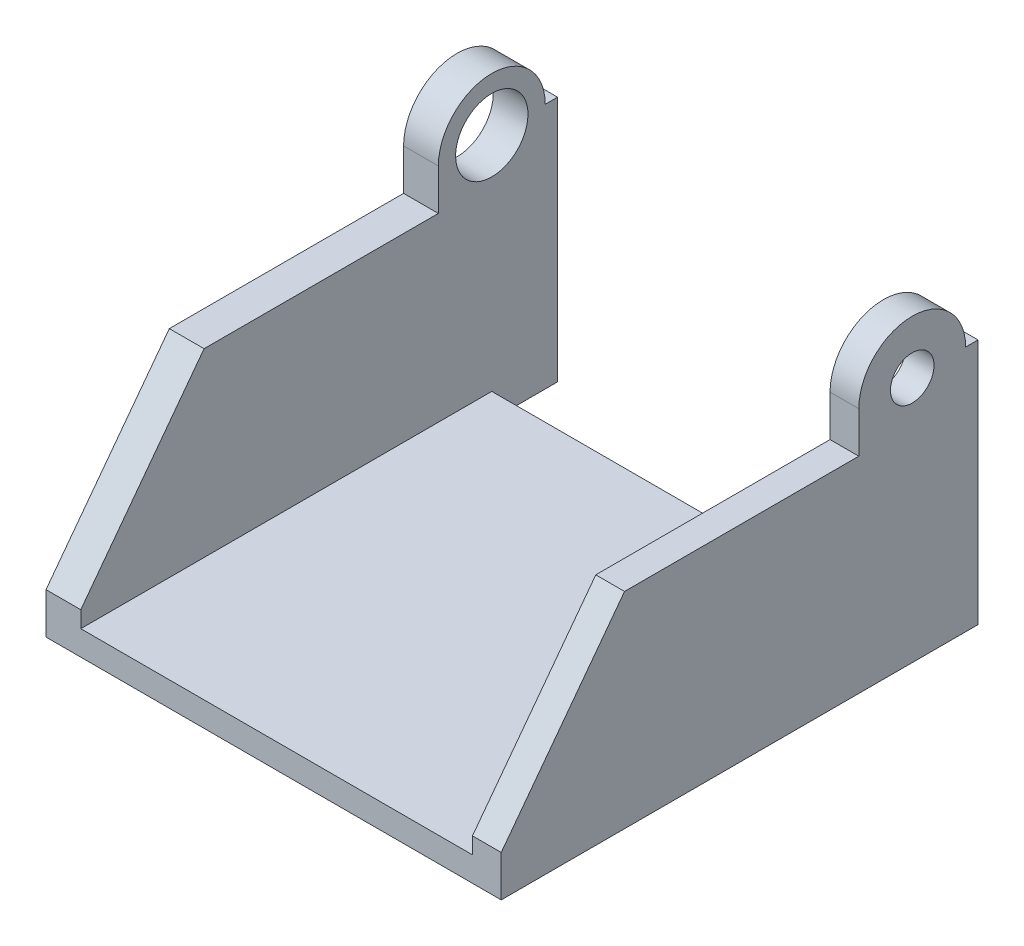
ISO-10303-21;
HEADER;
FILE_DESCRIPTION(('STEP AP214'),'2;1');
FILE_NAME('part.step','',(''),(''),'','','');
FILE_SCHEMA(('AUTOMOTIVE_DESIGN { 1 0 10303 214 1 1 1 1 }'));
ENDSEC;
DATA;
#1=APPLICATION_CONTEXT('core data for automotive mechanical design processes');
#2=APPLICATION_PROTOCOL_DEFINITION('international standard','automotive_design',2000,#1);
#3=PRODUCT_CONTEXT('',#1,'mechanical');
#4=PRODUCT('Part','Part','',(#3));
#5=PRODUCT_RELATED_PRODUCT_CATEGORY('part','',(#4));
#6=PRODUCT_DEFINITION_FORMATION('','',#4);
#7=PRODUCT_DEFINITION_CONTEXT('part definition',#1,'design');
#8=PRODUCT_DEFINITION('design','',#6,#7);
#9=PRODUCT_DEFINITION_SHAPE('','',#8);
#10=(LENGTH_UNIT() NAMED_UNIT(*) SI_UNIT(.MILLI.,.METRE.));
#11=(NAMED_UNIT(*) PLANE_ANGLE_UNIT() SI_UNIT($,.RADIAN.));
#12=(NAMED_UNIT(*) SI_UNIT($,.STERADIAN.) SOLID_ANGLE_UNIT());
#13=UNCERTAINTY_MEASURE_WITH_UNIT(LENGTH_MEASURE(1.E-05),#10,'distance_accuracy_value','');
#14=(GEOMETRIC_REPRESENTATION_CONTEXT(3) GLOBAL_UNCERTAINTY_ASSIGNED_CONTEXT((#13)) GLOBAL_UNIT_ASSIGNED_CONTEXT((#10,
#11,#12)) REPRESENTATION_CONTEXT('',''));
#15=CARTESIAN_POINT('',(0.,0.,0.));
#16=DIRECTION('',(0.,0.,1.));
#17=DIRECTION('',(1.,0.,0.));
#18=AXIS2_PLACEMENT_3D('',#15,#16,#17);
#19=CARTESIAN_POINT('',(-54.65,0.,50.));
#20=DIRECTION('',(0.,0.,1.));
#21=DIRECTION('',(-1.,0.,0.));
#22=AXIS2_PLACEMENT_3D('',#19,#20,#21);
#23=PLANE('',#22);
#24=DIRECTION('',(1.,0.,0.));
#25=VECTOR('',#24,1.);
#26=CARTESIAN_POINT('',(-54.65,-30.,50.));
#27=LINE('',#26,#25);
#28=CARTESIAN_POINT('',(-82.705,-30.,50.));
#29=VERTEX_POINT('',#28);
#30=CARTESIAN_POINT('',(-27.325,-30.,50.));
#31=VERTEX_POINT('',#30);
#32=EDGE_CURVE('E270',#29,#31,#27,.T.);
#33=ORIENTED_EDGE('',*,*,#32,.T.);
#34=DIRECTION('',(0.,-1.,0.));
#35=VECTOR('',#34,1.);
#36=CARTESIAN_POINT('',(-27.325,0.,50.));
#37=LINE('',#36,#35);
#38=CARTESIAN_POINT('',(-27.325,-25.,50.));
#39=VERTEX_POINT('',#38);
#40=EDGE_CURVE('E266',#39,#31,#37,.T.);
#41=ORIENTED_EDGE('',*,*,#40,.F.);
#42=DIRECTION('',(-1.,0.,0.));
#43=VECTOR('',#42,1.);
#44=CARTESIAN_POINT('',(-54.65,-25.,50.));
#45=LINE('',#44,#43);
#46=CARTESIAN_POINT('',(-30.825,-25.,50.));
#47=VERTEX_POINT('',#46);
#48=EDGE_CURVE('E296',#39,#47,#45,.T.);
#49=ORIENTED_EDGE('',*,*,#48,.T.);
#50=DIRECTION('',(0.,-1.,0.));
#51=VECTOR('',#50,1.);
#52=CARTESIAN_POINT('',(-30.825,0.,50.));
#53=LINE('',#52,#51);
#54=CARTESIAN_POINT('',(-30.825,-27.,50.));
#55=VERTEX_POINT('',#54);
#56=EDGE_CURVE('E279',#47,#55,#53,.T.);
#57=ORIENTED_EDGE('',*,*,#56,.T.);
#58=DIRECTION('',(-1.,0.,0.));
#59=VECTOR('',#58,1.);
#60=CARTESIAN_POINT('',(-54.65,-27.,50.));
#61=LINE('',#60,#59);
#62=CARTESIAN_POINT('',(-78.475,-27.,50.));
#63=VERTEX_POINT('',#62);
#64=EDGE_CURVE('E275',#55,#63,#61,.T.);
#65=ORIENTED_EDGE('',*,*,#64,.T.);
#66=DIRECTION('',(0.,-1.,0.));
#67=VECTOR('',#66,1.);
#68=CARTESIAN_POINT('',(-78.475,0.,50.));
#69=LINE('',#68,#67);
#70=CARTESIAN_POINT('',(-78.475,-25.,50.));
#71=VERTEX_POINT('',#70);
#72=EDGE_CURVE('E217',#71,#63,#69,.T.);
#73=ORIENTED_EDGE('',*,*,#72,.F.);
#74=DIRECTION('',(1.,0.,0.));
#75=VECTOR('',#74,1.);
#76=CARTESIAN_POINT('',(-54.65,-25.,50.));
#77=LINE('',#76,#75);
#78=CARTESIAN_POINT('',(-82.705,-25.,50.));
#79=VERTEX_POINT('',#78);
#80=EDGE_CURVE('E11',#79,#71,#77,.T.);
#81=ORIENTED_EDGE('',*,*,#80,.F.);
#82=DIRECTION('',(0.,-1.,0.));
#83=VECTOR('',#82,1.);
#84=CARTESIAN_POINT('',(-82.705,-25.,50.));
#85=LINE('',#84,#83);
#86=EDGE_CURVE('E363',#79,#29,#85,.T.);
#87=ORIENTED_EDGE('',*,*,#86,.T.);
#88=EDGE_LOOP('',(#33,#41,#49,#57,#65,#73,#81,#87));
#89=FACE_BOUND('',#88,.T.);
#90=ADVANCED_FACE('F49',(#89),#23,.T.);
#91=CARTESIAN_POINT('',(-54.65,-30.,50.));
#92=DIRECTION('',(0.,-1.,0.));
#93=DIRECTION('',(0.,0.,-1.));
#94=AXIS2_PLACEMENT_3D('',#91,#92,#93);
#95=PLANE('',#94);
#96=DIRECTION('',(1.,0.,0.));
#97=VECTOR('',#96,1.);
#98=CARTESIAN_POINT('',(-81.975,-30.,-8.));
#99=LINE('',#98,#97);
#100=CARTESIAN_POINT('',(-82.705,-30.,-8.));
#101=VERTEX_POINT('',#100);
#102=CARTESIAN_POINT('',(-78.475,-30.,-8.));
#103=VERTEX_POINT('',#102);
#104=EDGE_CURVE('E186',#101,#103,#99,.T.);
#105=ORIENTED_EDGE('',*,*,#104,.T.);
#106=DIRECTION('',(0.,0.,-1.));
#107=VECTOR('',#106,1.);
#108=CARTESIAN_POINT('',(-78.475,-30.,0.));
#109=LINE('',#108,#107);
#110=CARTESIAN_POINT('',(-78.475,-30.,0.));
#111=VERTEX_POINT('',#110);
#112=EDGE_CURVE('E329',#111,#103,#109,.T.);
#113=ORIENTED_EDGE('',*,*,#112,.F.);
#114=DIRECTION('',(1.,0.,0.));
#115=VECTOR('',#114,1.);
#116=CARTESIAN_POINT('',(-54.65,-30.,0.));
#117=LINE('',#116,#115);
#118=CARTESIAN_POINT('',(-30.825,-30.,0.));
#119=VERTEX_POINT('',#118);
#120=EDGE_CURVE('E257',#111,#119,#117,.T.);
#121=ORIENTED_EDGE('',*,*,#120,.T.);
#122=DIRECTION('',(0.,0.,-1.));
#123=VECTOR('',#122,1.);
#124=CARTESIAN_POINT('',(-30.825,-30.,0.));
#125=LINE('',#124,#123);
#126=CARTESIAN_POINT('',(-30.825,-30.,-8.));
#127=VERTEX_POINT('',#126);
#128=EDGE_CURVE('E248',#119,#127,#125,.T.);
#129=ORIENTED_EDGE('',*,*,#128,.T.);
#130=DIRECTION('',(-1.,0.,0.));
#131=VECTOR('',#130,1.);
#132=CARTESIAN_POINT('',(-27.325,-30.,-8.));
#133=LINE('',#132,#131);
#134=CARTESIAN_POINT('',(-27.325,-30.,-8.));
#135=VERTEX_POINT('',#134);
#136=EDGE_CURVE('E258',#135,#127,#133,.T.);
#137=ORIENTED_EDGE('',*,*,#136,.F.);
#138=DIRECTION('',(0.,0.,-1.));
#139=VECTOR('',#138,1.);
#140=CARTESIAN_POINT('',(-27.325,-30.,50.));
#141=LINE('',#140,#139);
#142=EDGE_CURVE('E292',#31,#135,#141,.T.);
#143=ORIENTED_EDGE('',*,*,#142,.F.);
#144=ORIENTED_EDGE('',*,*,#32,.F.);
#145=DIRECTION('',(0.,0.,-1.));
#146=VECTOR('',#145,1.);
#147=CARTESIAN_POINT('',(-82.705,-30.,50.));
#148=LINE('',#147,#146);
#149=EDGE_CURVE('E358',#29,#101,#148,.T.);
#150=ORIENTED_EDGE('',*,*,#149,.T.);
#151=EDGE_LOOP('',(#105,#113,#121,#129,#137,#143,#144,#150));
#152=FACE_BOUND('',#151,.T.);
#153=ADVANCED_FACE('F356',(#152),#95,.T.);
#154=CARTESIAN_POINT('',(-81.975,0.,0.));
#155=DIRECTION('',(0.,1.,0.));
#156=DIRECTION('',(0.,0.,1.));
#157=AXIS2_PLACEMENT_3D('',#154,#155,#156);
#158=PLANE('',#157);
#159=DIRECTION('',(1.,0.,0.));
#160=VECTOR('',#159,1.);
#161=CARTESIAN_POINT('',(-81.975,0.,-6.5));
#162=LINE('',#161,#160);
#163=CARTESIAN_POINT('',(-82.705,0.,-6.5));
#164=VERTEX_POINT('',#163);
#165=CARTESIAN_POINT('',(-78.475,0.,-6.5));
#166=VERTEX_POINT('',#165);
#167=EDGE_CURVE('E222',#164,#166,#162,.T.);
#168=ORIENTED_EDGE('',*,*,#167,.T.);
#169=DIRECTION('',(0.,0.,-1.));
#170=VECTOR('',#169,1.);
#171=CARTESIAN_POINT('',(-78.475,0.,0.));
#172=LINE('',#171,#170);
#173=CARTESIAN_POINT('',(-78.475,0.,-8.));
#174=VERTEX_POINT('',#173);
#175=EDGE_CURVE('E205',#166,#174,#172,.T.);
#176=ORIENTED_EDGE('',*,*,#175,.T.);
#177=DIRECTION('',(1.,0.,0.));
#178=VECTOR('',#177,1.);
#179=CARTESIAN_POINT('',(-81.975,0.,-8.));
#180=LINE('',#179,#178);
#181=CARTESIAN_POINT('',(-82.705,0.,-8.));
#182=VERTEX_POINT('',#181);
#183=EDGE_CURVE('E183',#182,#174,#180,.T.);
#184=ORIENTED_EDGE('',*,*,#183,.F.);
#185=DIRECTION('',(0.,0.,1.));
#186=VECTOR('',#185,1.);
#187=CARTESIAN_POINT('',(-82.705,0.,-8.));
#188=LINE('',#187,#186);
#189=EDGE_CURVE('E190',#182,#164,#188,.T.);
#190=ORIENTED_EDGE('',*,*,#189,.T.);
#191=EDGE_LOOP('',(#168,#176,#184,#190));
#192=FACE_BOUND('',#191,.T.);
#193=ADVANCED_FACE('F203',(#192),#158,.T.);
#194=CARTESIAN_POINT('',(-81.975,0.,0.));
#195=DIRECTION('',(1.,0.,0.));
#196=DIRECTION('',(0.,-1.,0.));
#197=AXIS2_PLACEMENT_3D('',#194,#195,#196);
#198=CYLINDRICAL_SURFACE('',#197,6.5);
#199=DIRECTION('',(1.,0.,0.));
#200=VECTOR('',#199,1.);
#201=CARTESIAN_POINT('',(-81.975,0.,6.5));
#202=LINE('',#201,#200);
#203=CARTESIAN_POINT('',(-82.705,0.,6.5));
#204=VERTEX_POINT('',#203);
#205=CARTESIAN_POINT('',(-78.475,0.,6.5));
#206=VERTEX_POINT('',#205);
#207=EDGE_CURVE('E211',#204,#206,#202,.T.);
#208=ORIENTED_EDGE('',*,*,#207,.T.);
#209=CARTESIAN_POINT('',(-78.475,0.,0.));
#210=DIRECTION('',(1.,0.,0.));
#211=DIRECTION('',(0.,1.,0.));
#212=AXIS2_PLACEMENT_3D('',#209,#210,#211);
#213=CIRCLE('',#212,6.5);
#214=EDGE_CURVE('E207',#166,#206,#213,.T.);
#215=ORIENTED_EDGE('',*,*,#214,.F.);
#216=ORIENTED_EDGE('',*,*,#167,.F.);
#217=CARTESIAN_POINT('',(-82.705,0.,0.));
#218=DIRECTION('',(1.,0.,0.));
#219=DIRECTION('',(0.,1.,0.));
#220=AXIS2_PLACEMENT_3D('',#217,#218,#219);
#221=CIRCLE('',#220,6.5);
#222=EDGE_CURVE('E197',#164,#204,#221,.T.);
#223=ORIENTED_EDGE('',*,*,#222,.T.);
#224=EDGE_LOOP('',(#208,#215,#216,#223));
#225=FACE_BOUND('',#224,.T.);
#226=ADVANCED_FACE('F339',(#225),#198,.T.);
#227=CARTESIAN_POINT('',(-81.975,0.,-8.));
#228=DIRECTION('',(0.,0.,-1.));
#229=DIRECTION('',(0.,1.,0.));
#230=AXIS2_PLACEMENT_3D('',#227,#228,#229);
#231=PLANE('',#230);
#232=ORIENTED_EDGE('',*,*,#183,.T.);
#233=DIRECTION('',(0.,-1.,0.));
#234=VECTOR('',#233,1.);
#235=CARTESIAN_POINT('',(-78.475,0.,-8.));
#236=LINE('',#235,#234);
#237=EDGE_CURVE('E326',#174,#103,#236,.T.);
#238=ORIENTED_EDGE('',*,*,#237,.T.);
#239=ORIENTED_EDGE('',*,*,#104,.F.);
#240=DIRECTION('',(0.,1.,0.));
#241=VECTOR('',#240,1.);
#242=CARTESIAN_POINT('',(-82.705,-30.,-8.));
#243=LINE('',#242,#241);
#244=EDGE_CURVE('E179',#101,#182,#243,.T.);
#245=ORIENTED_EDGE('',*,*,#244,.T.);
#246=EDGE_LOOP('',(#232,#238,#239,#245));
#247=FACE_BOUND('',#246,.T.);
#248=ADVANCED_FACE('F181',(#247),#231,.T.);
#249=CARTESIAN_POINT('',(-74.825,-5.00000000000001,0.));
#250=DIRECTION('',(0.,1.,0.));
#251=DIRECTION('',(1.,0.,0.));
#252=AXIS2_PLACEMENT_3D('',#249,#250,#251);
#253=PLANE('',#252);
#254=DIRECTION('',(-1.,0.,0.));
#255=VECTOR('',#254,1.);
#256=CARTESIAN_POINT('',(-74.825,-5.00000000000001,35.));
#257=LINE('',#256,#255);
#258=CARTESIAN_POINT('',(-78.475,-5.00000000000002,35.));
#259=VERTEX_POINT('',#258);
#260=CARTESIAN_POINT('',(-82.705,-5.00000000000001,35.));
#261=VERTEX_POINT('',#260);
#262=EDGE_CURVE('E362',#259,#261,#257,.T.);
#263=ORIENTED_EDGE('',*,*,#262,.F.);
#264=DIRECTION('',(0.,0.,1.));
#265=VECTOR('',#264,1.);
#266=CARTESIAN_POINT('',(-78.475,-5.00000000000001,50.));
#267=LINE('',#266,#265);
#268=CARTESIAN_POINT('',(-78.475,-5.00000000000001,6.5));
#269=VERTEX_POINT('',#268);
#270=EDGE_CURVE('E377',#269,#259,#267,.T.);
#271=ORIENTED_EDGE('',*,*,#270,.F.);
#272=DIRECTION('',(-1.,0.,0.));
#273=VECTOR('',#272,1.);
#274=CARTESIAN_POINT('',(-74.825,-5.00000000000001,6.5));
#275=LINE('',#274,#273);
#276=CARTESIAN_POINT('',(-82.705,-5.00000000000002,6.5));
#277=VERTEX_POINT('',#276);
#278=EDGE_CURVE('E347',#269,#277,#275,.T.);
#279=ORIENTED_EDGE('',*,*,#278,.T.);
#280=DIRECTION('',(0.,0.,1.));
#281=VECTOR('',#280,1.);
#282=CARTESIAN_POINT('',(-82.705,-5.00000000000002,6.5));
#283=LINE('',#282,#281);
#284=EDGE_CURVE('E401',#277,#261,#283,.T.);
#285=ORIENTED_EDGE('',*,*,#284,.T.);
#286=EDGE_LOOP('',(#263,#271,#279,#285));
#287=FACE_BOUND('',#286,.T.);
#288=ADVANCED_FACE('F406',(#287),#253,.T.);
#289=CARTESIAN_POINT('',(-74.825,15.,20.));
#290=DIRECTION('',(0.,0.6,0.8));
#291=DIRECTION('',(0.,-0.8,0.6));
#292=AXIS2_PLACEMENT_3D('',#289,#290,#291);
#293=PLANE('',#292);
#294=ORIENTED_EDGE('',*,*,#80,.T.);
#295=DIRECTION('',(0.,-0.8,0.6));
#296=VECTOR('',#295,1.);
#297=CARTESIAN_POINT('',(-78.475,-9.00000000000002,38.));
#298=LINE('',#297,#296);
#299=EDGE_CURVE('E351',#259,#71,#298,.T.);
#300=ORIENTED_EDGE('',*,*,#299,.F.);
#301=ORIENTED_EDGE('',*,*,#262,.T.);
#302=DIRECTION('',(0.,-0.8,0.6));
#303=VECTOR('',#302,1.);
#304=CARTESIAN_POINT('',(-82.705,-5.00000000000001,35.));
#305=LINE('',#304,#303);
#306=EDGE_CURVE('E369',#261,#79,#305,.T.);
#307=ORIENTED_EDGE('',*,*,#306,.T.);
#308=EDGE_LOOP('',(#294,#300,#301,#307));
#309=FACE_BOUND('',#308,.T.);
#310=ADVANCED_FACE('F409',(#309),#293,.T.);
#311=CARTESIAN_POINT('',(-74.825,0.,6.5));
#312=DIRECTION('',(0.,0.,1.));
#313=DIRECTION('',(0.,-1.,0.));
#314=AXIS2_PLACEMENT_3D('',#311,#312,#313);
#315=PLANE('',#314);
#316=ORIENTED_EDGE('',*,*,#278,.F.);
#317=DIRECTION('',(0.,-1.,0.));
#318=VECTOR('',#317,1.);
#319=CARTESIAN_POINT('',(-78.475,0.,6.5));
#320=LINE('',#319,#318);
#321=EDGE_CURVE('E345',#206,#269,#320,.T.);
#322=ORIENTED_EDGE('',*,*,#321,.F.);
#323=ORIENTED_EDGE('',*,*,#207,.F.);
#324=DIRECTION('',(0.,-1.,0.));
#325=VECTOR('',#324,1.);
#326=CARTESIAN_POINT('',(-82.705,0.,6.5));
#327=LINE('',#326,#325);
#328=EDGE_CURVE('E343',#204,#277,#327,.T.);
#329=ORIENTED_EDGE('',*,*,#328,.T.);
#330=EDGE_LOOP('',(#316,#322,#323,#329));
#331=FACE_BOUND('',#330,.T.);
#332=ADVANCED_FACE('F342',(#331),#315,.T.);
#333=CARTESIAN_POINT('',(-78.475,0.,50.));
#334=DIRECTION('',(-1.,0.,0.));
#335=DIRECTION('',(0.,1.,0.));
#336=AXIS2_PLACEMENT_3D('',#333,#334,#335);
#337=PLANE('',#336);
#338=CARTESIAN_POINT('',(-78.475,0.,0.));
#339=DIRECTION('',(1.,0.,0.));
#340=DIRECTION('',(0.,1.,0.));
#341=AXIS2_PLACEMENT_3D('',#338,#339,#340);
#342=CIRCLE('',#341,4.4);
#343=CARTESIAN_POINT('',(-78.475,4.39999999999999,0.));
#344=VERTEX_POINT('',#343);
#345=EDGE_CURVE('E468',#344,#344,#342,.T.);
#346=ORIENTED_EDGE('',*,*,#345,.F.);
#347=EDGE_LOOP('',(#346));
#348=FACE_BOUND('',#347,.T.);
#349=ORIENTED_EDGE('',*,*,#321,.T.);
#350=ORIENTED_EDGE('',*,*,#270,.T.);
#351=ORIENTED_EDGE('',*,*,#299,.T.);
#352=ORIENTED_EDGE('',*,*,#72,.T.);
#353=DIRECTION('',(0.,0.,-1.));
#354=VECTOR('',#353,1.);
#355=CARTESIAN_POINT('',(-78.475,-27.,50.));
#356=LINE('',#355,#354);
#357=CARTESIAN_POINT('',(-78.475,-27.,0.));
#358=VERTEX_POINT('',#357);
#359=EDGE_CURVE('E221',#63,#358,#356,.T.);
#360=ORIENTED_EDGE('',*,*,#359,.T.);
#361=DIRECTION('',(0.,1.,0.));
#362=VECTOR('',#361,1.);
#363=CARTESIAN_POINT('',(-78.475,0.,0.));
#364=LINE('',#363,#362);
#365=EDGE_CURVE('E66',#111,#358,#364,.T.);
#366=ORIENTED_EDGE('',*,*,#365,.F.);
#367=ORIENTED_EDGE('',*,*,#112,.T.);
#368=ORIENTED_EDGE('',*,*,#237,.F.);
#369=ORIENTED_EDGE('',*,*,#175,.F.);
#370=ORIENTED_EDGE('',*,*,#214,.T.);
#371=EDGE_LOOP('',(#349,#350,#351,#352,#360,#366,#367,#368,#369,#370));
#372=FACE_BOUND('',#371,.T.);
#373=ADVANCED_FACE('F353',(#348,#372),#337,.F.);
#374=CARTESIAN_POINT('',(-27.325,0.,50.));
#375=DIRECTION('',(-1.,0.,0.));
#376=DIRECTION('',(0.,1.,0.));
#377=AXIS2_PLACEMENT_3D('',#374,#375,#376);
#378=PLANE('',#377);
#379=CARTESIAN_POINT('',(-27.325,0.,0.));
#380=DIRECTION('',(-1.,0.,0.));
#381=DIRECTION('',(0.,-1.,0.));
#382=AXIS2_PLACEMENT_3D('',#379,#380,#381);
#383=CIRCLE('',#382,2.65);
#384=CARTESIAN_POINT('',(-27.325,-2.65,0.));
#385=VERTEX_POINT('',#384);
#386=EDGE_CURVE('E465',#385,#385,#383,.T.);
#387=ORIENTED_EDGE('',*,*,#386,.T.);
#388=EDGE_LOOP('',(#387));
#389=FACE_BOUND('',#388,.T.);
#390=DIRECTION('',(0.,0.,1.));
#391=VECTOR('',#390,1.);
#392=CARTESIAN_POINT('',(-27.325,-5.,0.));
#393=LINE('',#392,#391);
#394=CARTESIAN_POINT('',(-27.325,-5.,6.5));
#395=VERTEX_POINT('',#394);
#396=CARTESIAN_POINT('',(-27.325,-5.,35.));
#397=VERTEX_POINT('',#396);
#398=EDGE_CURVE('E383',#395,#397,#393,.T.);
#399=ORIENTED_EDGE('',*,*,#398,.T.);
#400=DIRECTION('',(0.,-0.8,0.6));
#401=VECTOR('',#400,1.);
#402=CARTESIAN_POINT('',(-27.325,15.,20.));
#403=LINE('',#402,#401);
#404=EDGE_CURVE('E387',#397,#39,#403,.T.);
#405=ORIENTED_EDGE('',*,*,#404,.T.);
#406=ORIENTED_EDGE('',*,*,#40,.T.);
#407=ORIENTED_EDGE('',*,*,#142,.T.);
#408=DIRECTION('',(0.,-1.,0.));
#409=VECTOR('',#408,1.);
#410=CARTESIAN_POINT('',(-27.325,0.,-8.));
#411=LINE('',#410,#409);
#412=CARTESIAN_POINT('',(-27.325,0.,-8.));
#413=VERTEX_POINT('',#412);
#414=EDGE_CURVE('E235',#413,#135,#411,.T.);
#415=ORIENTED_EDGE('',*,*,#414,.F.);
#416=DIRECTION('',(0.,0.,-1.));
#417=VECTOR('',#416,1.);
#418=CARTESIAN_POINT('',(-27.325,0.,0.));
#419=LINE('',#418,#417);
#420=CARTESIAN_POINT('',(-27.325,0.,-6.5));
#421=VERTEX_POINT('',#420);
#422=EDGE_CURVE('E226',#421,#413,#419,.T.);
#423=ORIENTED_EDGE('',*,*,#422,.F.);
#424=CARTESIAN_POINT('',(-27.325,0.,0.));
#425=DIRECTION('',(1.,0.,0.));
#426=DIRECTION('',(0.,1.,0.));
#427=AXIS2_PLACEMENT_3D('',#424,#425,#426);
#428=CIRCLE('',#427,6.5);
#429=CARTESIAN_POINT('',(-27.325,0.,6.5));
#430=VERTEX_POINT('',#429);
#431=EDGE_CURVE('E230',#421,#430,#428,.T.);
#432=ORIENTED_EDGE('',*,*,#431,.T.);
#433=DIRECTION('',(0.,-1.,0.));
#434=VECTOR('',#433,1.);
#435=CARTESIAN_POINT('',(-27.325,0.,6.5));
#436=LINE('',#435,#434);
#437=EDGE_CURVE('E380',#430,#395,#436,.T.);
#438=ORIENTED_EDGE('',*,*,#437,.T.);
#439=EDGE_LOOP('',(#399,#405,#406,#407,#415,#423,#432,#438));
#440=FACE_BOUND('',#439,.T.);
#441=ADVANCED_FACE('F51',(#389,#440),#378,.F.);
#442=CARTESIAN_POINT('',(-54.65,-27.,50.));
#443=DIRECTION('',(0.,1.,0.));
#444=DIRECTION('',(0.,0.,1.));
#445=AXIS2_PLACEMENT_3D('',#442,#443,#444);
#446=PLANE('',#445);
#447=DIRECTION('',(-1.,0.,0.));
#448=VECTOR('',#447,1.);
#449=CARTESIAN_POINT('',(-54.65,-27.,0.));
#450=LINE('',#449,#448);
#451=CARTESIAN_POINT('',(-30.825,-27.,0.));
#452=VERTEX_POINT('',#451);
#453=EDGE_CURVE('E271',#452,#358,#450,.T.);
#454=ORIENTED_EDGE('',*,*,#453,.T.);
#455=ORIENTED_EDGE('',*,*,#359,.F.);
#456=ORIENTED_EDGE('',*,*,#64,.F.);
#457=DIRECTION('',(0.,0.,-1.));
#458=VECTOR('',#457,1.);
#459=CARTESIAN_POINT('',(-30.825,-27.,50.));
#460=LINE('',#459,#458);
#461=EDGE_CURVE('E283',#55,#452,#460,.T.);
#462=ORIENTED_EDGE('',*,*,#461,.T.);
#463=EDGE_LOOP('',(#454,#455,#456,#462));
#464=FACE_BOUND('',#463,.T.);
#465=ADVANCED_FACE('F412',(#464),#446,.T.);
#466=CARTESIAN_POINT('',(-30.825,0.,50.));
#467=DIRECTION('',(-1.,0.,0.));
#468=DIRECTION('',(0.,1.,0.));
#469=AXIS2_PLACEMENT_3D('',#466,#467,#468);
#470=PLANE('',#469);
#471=CARTESIAN_POINT('',(-30.825,0.,0.));
#472=DIRECTION('',(1.,0.,0.));
#473=DIRECTION('',(0.,1.,0.));
#474=AXIS2_PLACEMENT_3D('',#471,#472,#473);
#475=CIRCLE('',#474,2.65);
#476=CARTESIAN_POINT('',(-30.825,2.65,0.));
#477=VERTEX_POINT('',#476);
#478=EDGE_CURVE('E53',#477,#477,#475,.T.);
#479=ORIENTED_EDGE('',*,*,#478,.T.);
#480=EDGE_LOOP('',(#479));
#481=FACE_BOUND('',#480,.T.);
#482=DIRECTION('',(0.,1.,0.));
#483=VECTOR('',#482,1.);
#484=CARTESIAN_POINT('',(-30.825,0.,6.5));
#485=LINE('',#484,#483);
#486=CARTESIAN_POINT('',(-30.825,-5.,6.5));
#487=VERTEX_POINT('',#486);
#488=CARTESIAN_POINT('',(-30.825,0.,6.5));
#489=VERTEX_POINT('',#488);
#490=EDGE_CURVE('E308',#487,#489,#485,.T.);
#491=ORIENTED_EDGE('',*,*,#490,.T.);
#492=CARTESIAN_POINT('',(-30.825,0.,0.));
#493=DIRECTION('',(1.,0.,0.));
#494=DIRECTION('',(0.,1.,0.));
#495=AXIS2_PLACEMENT_3D('',#492,#493,#494);
#496=CIRCLE('',#495,6.5);
#497=CARTESIAN_POINT('',(-30.825,0.,-6.5));
#498=VERTEX_POINT('',#497);
#499=EDGE_CURVE('E242',#498,#489,#496,.T.);
#500=ORIENTED_EDGE('',*,*,#499,.F.);
#501=DIRECTION('',(0.,0.,-1.));
#502=VECTOR('',#501,1.);
#503=CARTESIAN_POINT('',(-30.825,0.,0.));
#504=LINE('',#503,#502);
#505=CARTESIAN_POINT('',(-30.825,0.,-8.));
#506=VERTEX_POINT('',#505);
#507=EDGE_CURVE('E225',#498,#506,#504,.T.);
#508=ORIENTED_EDGE('',*,*,#507,.T.);
#509=DIRECTION('',(0.,-1.,0.));
#510=VECTOR('',#509,1.);
#511=CARTESIAN_POINT('',(-30.825,0.,-8.));
#512=LINE('',#511,#510);
#513=EDGE_CURVE('E231',#506,#127,#512,.T.);
#514=ORIENTED_EDGE('',*,*,#513,.T.);
#515=ORIENTED_EDGE('',*,*,#128,.F.);
#516=DIRECTION('',(0.,1.,0.));
#517=VECTOR('',#516,1.);
#518=CARTESIAN_POINT('',(-30.825,0.,0.));
#519=LINE('',#518,#517);
#520=EDGE_CURVE('E245',#119,#452,#519,.T.);
#521=ORIENTED_EDGE('',*,*,#520,.T.);
#522=ORIENTED_EDGE('',*,*,#461,.F.);
#523=ORIENTED_EDGE('',*,*,#56,.F.);
#524=DIRECTION('',(0.,0.8,-0.6));
#525=VECTOR('',#524,1.);
#526=CARTESIAN_POINT('',(-30.825,-9.00000000000001,38.));
#527=LINE('',#526,#525);
#528=CARTESIAN_POINT('',(-30.825,-5.,35.));
#529=VERTEX_POINT('',#528);
#530=EDGE_CURVE('E310',#47,#529,#527,.T.);
#531=ORIENTED_EDGE('',*,*,#530,.T.);
#532=DIRECTION('',(0.,0.,-1.));
#533=VECTOR('',#532,1.);
#534=CARTESIAN_POINT('',(-30.825,-5.,50.));
#535=LINE('',#534,#533);
#536=EDGE_CURVE('E59',#529,#487,#535,.T.);
#537=ORIENTED_EDGE('',*,*,#536,.T.);
#538=EDGE_LOOP('',(#491,#500,#508,#514,#515,#521,#522,#523,#531,#537));
#539=FACE_BOUND('',#538,.T.);
#540=ADVANCED_FACE('F306',(#481,#539),#470,.T.);
#541=CARTESIAN_POINT('',(-54.65,0.,0.));
#542=DIRECTION('',(0.,0.,1.));
#543=DIRECTION('',(-1.,0.,0.));
#544=AXIS2_PLACEMENT_3D('',#541,#542,#543);
#545=PLANE('',#544);
#546=ORIENTED_EDGE('',*,*,#453,.F.);
#547=ORIENTED_EDGE('',*,*,#520,.F.);
#548=ORIENTED_EDGE('',*,*,#120,.F.);
#549=ORIENTED_EDGE('',*,*,#365,.T.);
#550=EDGE_LOOP('',(#546,#547,#548,#549));
#551=FACE_BOUND('',#550,.T.);
#552=ADVANCED_FACE('F415',(#551),#545,.F.);
#553=CARTESIAN_POINT('',(-27.325,0.,0.));
#554=DIRECTION('',(0.,-1.,0.));
#555=DIRECTION('',(0.,0.,-1.));
#556=AXIS2_PLACEMENT_3D('',#553,#554,#555);
#557=PLANE('',#556);
#558=ORIENTED_EDGE('',*,*,#507,.F.);
#559=DIRECTION('',(-1.,0.,0.));
#560=VECTOR('',#559,1.);
#561=CARTESIAN_POINT('',(-27.325,0.,-6.5));
#562=LINE('',#561,#560);
#563=EDGE_CURVE('E238',#421,#498,#562,.T.);
#564=ORIENTED_EDGE('',*,*,#563,.F.);
#565=ORIENTED_EDGE('',*,*,#422,.T.);
#566=DIRECTION('',(-1.,0.,0.));
#567=VECTOR('',#566,1.);
#568=CARTESIAN_POINT('',(-27.325,0.,-8.));
#569=LINE('',#568,#567);
#570=EDGE_CURVE('E254',#413,#506,#569,.T.);
#571=ORIENTED_EDGE('',*,*,#570,.T.);
#572=EDGE_LOOP('',(#558,#564,#565,#571));
#573=FACE_BOUND('',#572,.T.);
#574=ADVANCED_FACE('F426',(#573),#557,.F.);
#575=CARTESIAN_POINT('',(-27.325,0.,-8.));
#576=DIRECTION('',(0.,0.,1.));
#577=DIRECTION('',(0.,-1.,0.));
#578=AXIS2_PLACEMENT_3D('',#575,#576,#577);
#579=PLANE('',#578);
#580=ORIENTED_EDGE('',*,*,#513,.F.);
#581=ORIENTED_EDGE('',*,*,#570,.F.);
#582=ORIENTED_EDGE('',*,*,#414,.T.);
#583=ORIENTED_EDGE('',*,*,#136,.T.);
#584=EDGE_LOOP('',(#580,#581,#582,#583));
#585=FACE_BOUND('',#584,.T.);
#586=ADVANCED_FACE('F421',(#585),#579,.F.);
#587=CARTESIAN_POINT('',(-27.325,0.,0.));
#588=DIRECTION('',(-1.,0.,0.));
#589=DIRECTION('',(0.,1.,0.));
#590=AXIS2_PLACEMENT_3D('',#587,#588,#589);
#591=CYLINDRICAL_SURFACE('',#590,6.5);
#592=ORIENTED_EDGE('',*,*,#499,.T.);
#593=DIRECTION('',(-1.,0.,0.));
#594=VECTOR('',#593,1.);
#595=CARTESIAN_POINT('',(-27.325,0.,6.5));
#596=LINE('',#595,#594);
#597=EDGE_CURVE('E74',#430,#489,#596,.T.);
#598=ORIENTED_EDGE('',*,*,#597,.F.);
#599=ORIENTED_EDGE('',*,*,#431,.F.);
#600=ORIENTED_EDGE('',*,*,#563,.T.);
#601=EDGE_LOOP('',(#592,#598,#599,#600));
#602=FACE_BOUND('',#601,.T.);
#603=ADVANCED_FACE('F428',(#602),#591,.T.);
#604=CARTESIAN_POINT('',(-34.475,0.,6.5));
#605=DIRECTION('',(0.,0.,-1.));
#606=DIRECTION('',(0.,1.,0.));
#607=AXIS2_PLACEMENT_3D('',#604,#605,#606);
#608=PLANE('',#607);
#609=ORIENTED_EDGE('',*,*,#490,.F.);
#610=DIRECTION('',(1.,0.,0.));
#611=VECTOR('',#610,1.);
#612=CARTESIAN_POINT('',(-34.475,-5.,6.5));
#613=LINE('',#612,#611);
#614=EDGE_CURVE('E313',#487,#395,#613,.T.);
#615=ORIENTED_EDGE('',*,*,#614,.T.);
#616=ORIENTED_EDGE('',*,*,#437,.F.);
#617=ORIENTED_EDGE('',*,*,#597,.T.);
#618=EDGE_LOOP('',(#609,#615,#616,#617));
#619=FACE_BOUND('',#618,.T.);
#620=ADVANCED_FACE('F312',(#619),#608,.F.);
#621=CARTESIAN_POINT('',(-34.475,15.,20.));
#622=DIRECTION('',(0.,-0.6,-0.8));
#623=DIRECTION('',(0.,0.8,-0.6));
#624=AXIS2_PLACEMENT_3D('',#621,#622,#623);
#625=PLANE('',#624);
#626=ORIENTED_EDGE('',*,*,#530,.F.);
#627=ORIENTED_EDGE('',*,*,#48,.F.);
#628=ORIENTED_EDGE('',*,*,#404,.F.);
#629=DIRECTION('',(1.,0.,0.));
#630=VECTOR('',#629,1.);
#631=CARTESIAN_POINT('',(-34.475,-5.00000000000001,35.));
#632=LINE('',#631,#630);
#633=EDGE_CURVE('E316',#529,#397,#632,.T.);
#634=ORIENTED_EDGE('',*,*,#633,.F.);
#635=EDGE_LOOP('',(#626,#627,#628,#634));
#636=FACE_BOUND('',#635,.T.);
#637=ADVANCED_FACE('F396',(#636),#625,.F.);
#638=CARTESIAN_POINT('',(-34.475,-5.,0.));
#639=DIRECTION('',(0.,-1.,0.));
#640=DIRECTION('',(-1.,0.,0.));
#641=AXIS2_PLACEMENT_3D('',#638,#639,#640);
#642=PLANE('',#641);
#643=ORIENTED_EDGE('',*,*,#536,.F.);
#644=ORIENTED_EDGE('',*,*,#633,.T.);
#645=ORIENTED_EDGE('',*,*,#398,.F.);
#646=ORIENTED_EDGE('',*,*,#614,.F.);
#647=EDGE_LOOP('',(#643,#644,#645,#646));
#648=FACE_BOUND('',#647,.T.);
#649=ADVANCED_FACE('F429',(#648),#642,.F.);
#650=CARTESIAN_POINT('',(-82.705,0.,0.));
#651=DIRECTION('',(-1.,0.,0.));
#652=DIRECTION('',(0.,1.,0.));
#653=AXIS2_PLACEMENT_3D('',#650,#651,#652);
#654=PLANE('',#653);
#655=ORIENTED_EDGE('',*,*,#244,.F.);
#656=ORIENTED_EDGE('',*,*,#149,.F.);
#657=ORIENTED_EDGE('',*,*,#86,.F.);
#658=ORIENTED_EDGE('',*,*,#306,.F.);
#659=ORIENTED_EDGE('',*,*,#284,.F.);
#660=ORIENTED_EDGE('',*,*,#328,.F.);
#661=ORIENTED_EDGE('',*,*,#222,.F.);
#662=ORIENTED_EDGE('',*,*,#189,.F.);
#663=EDGE_LOOP('',(#655,#656,#657,#658,#659,#660,#661,#662));
#664=FACE_BOUND('',#663,.T.);
#665=CARTESIAN_POINT('',(-82.705,0.,0.));
#666=DIRECTION('',(1.,0.,0.));
#667=DIRECTION('',(0.,1.,0.));
#668=AXIS2_PLACEMENT_3D('',#665,#666,#667);
#669=CIRCLE('',#668,4.4);
#670=CARTESIAN_POINT('',(-82.705,4.39999999999998,0.));
#671=VERTEX_POINT('',#670);
#672=EDGE_CURVE('E191',#671,#671,#669,.T.);
#673=ORIENTED_EDGE('',*,*,#672,.T.);
#674=EDGE_LOOP('',(#673));
#675=FACE_BOUND('',#674,.T.);
#676=ADVANCED_FACE('F194',(#664,#675),#654,.T.);
#677=CARTESIAN_POINT('',(-82.705,0.,0.));
#678=DIRECTION('',(1.,0.,0.));
#679=DIRECTION('',(0.,-1.,0.));
#680=AXIS2_PLACEMENT_3D('',#677,#678,#679);
#681=CYLINDRICAL_SURFACE('',#680,4.4);
#682=ORIENTED_EDGE('',*,*,#672,.F.);
#683=EDGE_LOOP('',(#682));
#684=FACE_BOUND('',#683,.T.);
#685=ORIENTED_EDGE('',*,*,#345,.T.);
#686=EDGE_LOOP('',(#685));
#687=FACE_BOUND('',#686,.T.);
#688=ADVANCED_FACE('F436',(#684,#687),#681,.F.);
#689=CARTESIAN_POINT('',(-32.375,0.,0.));
#690=DIRECTION('',(1.,0.,0.));
#691=DIRECTION('',(0.,-1.,0.));
#692=AXIS2_PLACEMENT_3D('',#689,#690,#691);
#693=CYLINDRICAL_SURFACE('',#692,2.65);
#694=ORIENTED_EDGE('',*,*,#478,.F.);
#695=EDGE_LOOP('',(#694));
#696=FACE_BOUND('',#695,.T.);
#697=ORIENTED_EDGE('',*,*,#386,.F.);
#698=EDGE_LOOP('',(#697));
#699=FACE_BOUND('',#698,.T.);
#700=ADVANCED_FACE('F486',(#696,#699),#693,.F.);
#701=CLOSED_SHELL('',(#90,#153,#193,#226,#248,#288,#310,#332,#373,#441,#465,#540,#552,#574,#586,
#603,#620,#637,#649,#676,#688,#700));
#702=MANIFOLD_SOLID_BREP('B2',#701);
#703=ADVANCED_BREP_SHAPE_REPRESENTATION('',(#18,#702),#14);
#704=SHAPE_DEFINITION_REPRESENTATION(#9,#703);
ENDSEC;
END-ISO-10303-21;
